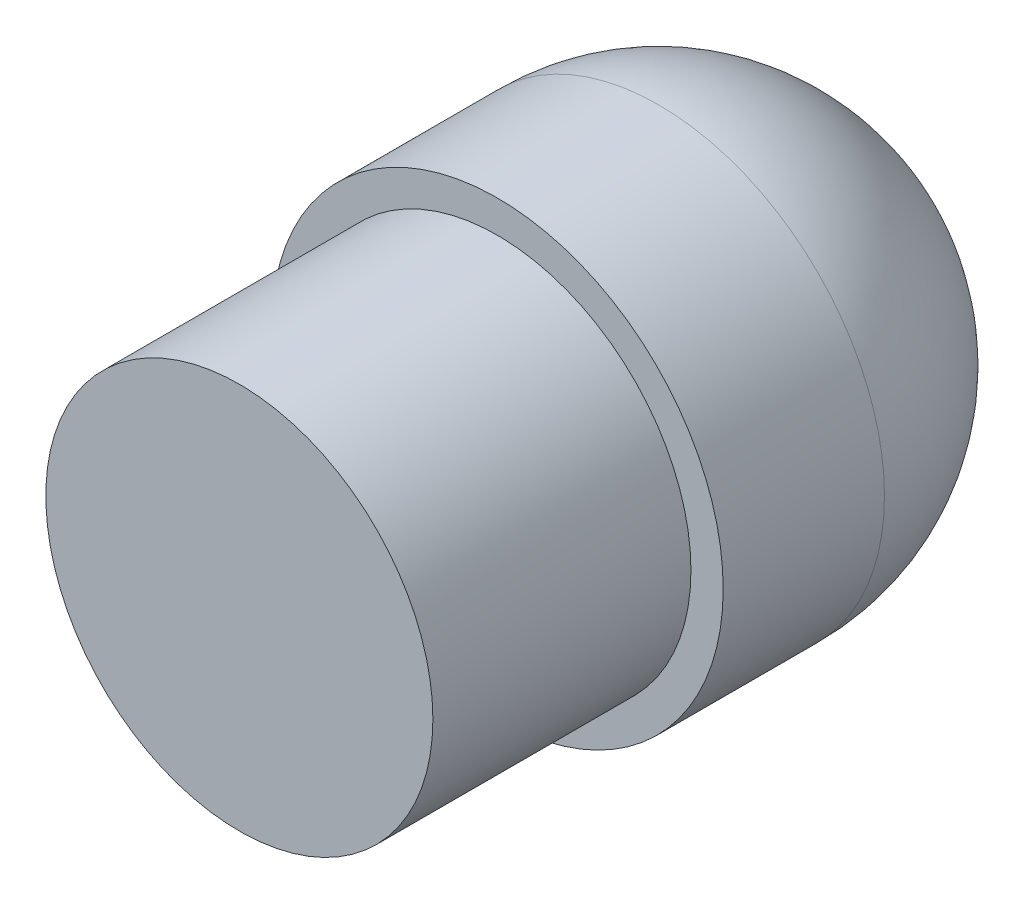
ISO-10303-21;
HEADER;
FILE_DESCRIPTION(('STEP AP214'),'2;1');
FILE_NAME('part.step','',(''),(''),'','','');
FILE_SCHEMA(('AUTOMOTIVE_DESIGN { 1 0 10303 214 1 1 1 1 }'));
ENDSEC;
DATA;
#1=APPLICATION_CONTEXT('core data for automotive mechanical design processes');
#2=APPLICATION_PROTOCOL_DEFINITION('international standard','automotive_design',2000,#1);
#3=PRODUCT_CONTEXT('',#1,'mechanical');
#4=PRODUCT('Part','Part','',(#3));
#5=PRODUCT_RELATED_PRODUCT_CATEGORY('part','',(#4));
#6=PRODUCT_DEFINITION_FORMATION('','',#4);
#7=PRODUCT_DEFINITION_CONTEXT('part definition',#1,'design');
#8=PRODUCT_DEFINITION('design','',#6,#7);
#9=PRODUCT_DEFINITION_SHAPE('','',#8);
#10=(LENGTH_UNIT() NAMED_UNIT(*) SI_UNIT(.MILLI.,.METRE.));
#11=(NAMED_UNIT(*) PLANE_ANGLE_UNIT() SI_UNIT($,.RADIAN.));
#12=(NAMED_UNIT(*) SI_UNIT($,.STERADIAN.) SOLID_ANGLE_UNIT());
#13=UNCERTAINTY_MEASURE_WITH_UNIT(LENGTH_MEASURE(1.E-05),#10,'distance_accuracy_value','');
#14=(GEOMETRIC_REPRESENTATION_CONTEXT(3) GLOBAL_UNCERTAINTY_ASSIGNED_CONTEXT((#13)) GLOBAL_UNIT_ASSIGNED_CONTEXT((#10,
#11,#12)) REPRESENTATION_CONTEXT('',''));
#15=CARTESIAN_POINT('',(0.,0.,0.));
#16=DIRECTION('',(0.,0.,1.));
#17=DIRECTION('',(1.,0.,0.));
#18=AXIS2_PLACEMENT_3D('',#15,#16,#17);
#19=CARTESIAN_POINT('',(0.,0.,0.));
#20=DIRECTION('',(0.,0.,-1.));
#21=DIRECTION('',(-1.,0.,0.));
#22=AXIS2_PLACEMENT_3D('',#19,#20,#21);
#23=PLANE('',#22);
#24=CARTESIAN_POINT('',(0.,0.,0.));
#25=DIRECTION('',(0.,0.,1.));
#26=DIRECTION('',(1.,0.,0.));
#27=AXIS2_PLACEMENT_3D('',#24,#25,#26);
#28=CIRCLE('',#27,15.);
#29=CARTESIAN_POINT('',(15.,0.,0.));
#30=VERTEX_POINT('',#29);
#31=EDGE_CURVE('E10',#30,#30,#28,.T.);
#32=ORIENTED_EDGE('',*,*,#31,.T.);
#33=EDGE_LOOP('',(#32));
#34=FACE_BOUND('',#33,.T.);
#35=ADVANCED_FACE('F31',(#34),#23,.F.);
#36=CARTESIAN_POINT('',(0.,0.,0.));
#37=DIRECTION('',(0.,0.,1.));
#38=DIRECTION('',(1.,0.,0.));
#39=AXIS2_PLACEMENT_3D('',#36,#37,#38);
#40=CYLINDRICAL_SURFACE('',#39,15.);
#41=ORIENTED_EDGE('',*,*,#31,.F.);
#42=EDGE_LOOP('',(#41));
#43=FACE_BOUND('',#42,.T.);
#44=CARTESIAN_POINT('',(0.,0.,-20.));
#45=DIRECTION('',(0.,0.,1.));
#46=DIRECTION('',(1.,0.,0.));
#47=AXIS2_PLACEMENT_3D('',#44,#45,#46);
#48=CIRCLE('',#47,15.);
#49=CARTESIAN_POINT('',(15.,0.,-20.));
#50=VERTEX_POINT('',#49);
#51=EDGE_CURVE('E37',#50,#50,#48,.T.);
#52=ORIENTED_EDGE('',*,*,#51,.T.);
#53=EDGE_LOOP('',(#52));
#54=FACE_BOUND('',#53,.T.);
#55=ADVANCED_FACE('F63',(#43,#54),#40,.T.);
#56=CARTESIAN_POINT('',(0.,15.,-20.));
#57=DIRECTION('',(0.,0.,-1.));
#58=DIRECTION('',(-1.,0.,0.));
#59=AXIS2_PLACEMENT_3D('',#56,#57,#58);
#60=PLANE('',#59);
#61=ORIENTED_EDGE('',*,*,#51,.F.);
#62=EDGE_LOOP('',(#61));
#63=FACE_BOUND('',#62,.T.);
#64=CARTESIAN_POINT('',(0.,0.,-20.));
#65=DIRECTION('',(0.,0.,1.));
#66=DIRECTION('',(1.,0.,0.));
#67=AXIS2_PLACEMENT_3D('',#64,#65,#66);
#68=CIRCLE('',#67,17.5);
#69=CARTESIAN_POINT('',(17.5,0.,-20.));
#70=VERTEX_POINT('',#69);
#71=EDGE_CURVE('E41',#70,#70,#68,.T.);
#72=ORIENTED_EDGE('',*,*,#71,.T.);
#73=EDGE_LOOP('',(#72));
#74=FACE_BOUND('',#73,.T.);
#75=ADVANCED_FACE('F59',(#63,#74),#60,.F.);
#76=CARTESIAN_POINT('',(0.,0.,0.));
#77=DIRECTION('',(0.,0.,1.));
#78=DIRECTION('',(1.,0.,0.));
#79=AXIS2_PLACEMENT_3D('',#76,#77,#78);
#80=CYLINDRICAL_SURFACE('',#79,17.5);
#81=ORIENTED_EDGE('',*,*,#71,.F.);
#82=EDGE_LOOP('',(#81));
#83=FACE_BOUND('',#82,.T.);
#84=CARTESIAN_POINT('',(0.,0.,-32.5));
#85=DIRECTION('',(0.,0.,1.));
#86=DIRECTION('',(1.,0.,0.));
#87=AXIS2_PLACEMENT_3D('',#84,#85,#86);
#88=CIRCLE('',#87,17.5);
#89=CARTESIAN_POINT('',(17.5,0.,-32.5));
#90=VERTEX_POINT('',#89);
#91=EDGE_CURVE('E45',#90,#90,#88,.T.);
#92=ORIENTED_EDGE('',*,*,#91,.T.);
#93=EDGE_LOOP('',(#92));
#94=FACE_BOUND('',#93,.T.);
#95=ADVANCED_FACE('F51',(#83,#94),#80,.T.);
#96=CARTESIAN_POINT('',(0.,0.,-32.5));
#97=DIRECTION('',(0.,0.,1.));
#98=DIRECTION('',(0.,1.,0.));
#99=AXIS2_PLACEMENT_3D('',#96,#97,#98);
#100=SPHERICAL_SURFACE('',#99,17.5);
#101=ORIENTED_EDGE('',*,*,#91,.F.);
#102=EDGE_LOOP('',(#101));
#103=FACE_BOUND('',#102,.T.);
#104=ADVANCED_FACE('F53',(#103),#100,.T.);
#105=CLOSED_SHELL('',(#35,#55,#75,#95,#104));
#106=MANIFOLD_SOLID_BREP('B2',#105);
#107=ADVANCED_BREP_SHAPE_REPRESENTATION('',(#18,#106),#14);
#108=SHAPE_DEFINITION_REPRESENTATION(#9,#107);
ENDSEC;
END-ISO-10303-21;
